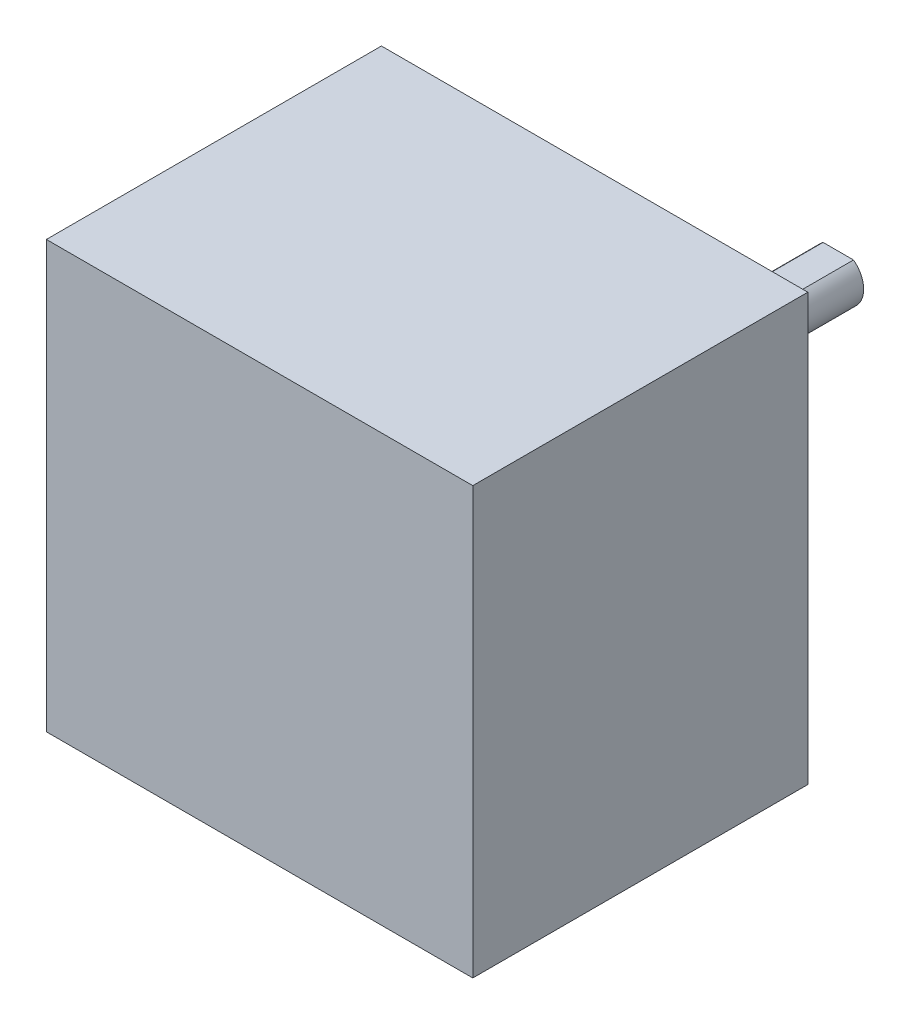
ISO-10303-21;
HEADER;
FILE_DESCRIPTION(('STEP AP214'),'2;1');
FILE_NAME('part.step','',(''),(''),'','','');
FILE_SCHEMA(('AUTOMOTIVE_DESIGN { 1 0 10303 214 1 1 1 1 }'));
ENDSEC;
DATA;
#1=APPLICATION_CONTEXT('core data for automotive mechanical design processes');
#2=APPLICATION_PROTOCOL_DEFINITION('international standard','automotive_design',2000,#1);
#3=PRODUCT_CONTEXT('',#1,'mechanical');
#4=PRODUCT('Part','Part','',(#3));
#5=PRODUCT_RELATED_PRODUCT_CATEGORY('part','',(#4));
#6=PRODUCT_DEFINITION_FORMATION('','',#4);
#7=PRODUCT_DEFINITION_CONTEXT('part definition',#1,'design');
#8=PRODUCT_DEFINITION('design','',#6,#7);
#9=PRODUCT_DEFINITION_SHAPE('','',#8);
#10=(LENGTH_UNIT() NAMED_UNIT(*) SI_UNIT(.MILLI.,.METRE.));
#11=(NAMED_UNIT(*) PLANE_ANGLE_UNIT() SI_UNIT($,.RADIAN.));
#12=(NAMED_UNIT(*) SI_UNIT($,.STERADIAN.) SOLID_ANGLE_UNIT());
#13=UNCERTAINTY_MEASURE_WITH_UNIT(LENGTH_MEASURE(1.E-05),#10,'distance_accuracy_value','');
#14=(GEOMETRIC_REPRESENTATION_CONTEXT(3) GLOBAL_UNCERTAINTY_ASSIGNED_CONTEXT((#13)) GLOBAL_UNIT_ASSIGNED_CONTEXT((#10,
#11,#12)) REPRESENTATION_CONTEXT('',''));
#15=CARTESIAN_POINT('',(0.,0.,0.));
#16=DIRECTION('',(0.,0.,1.));
#17=DIRECTION('',(1.,0.,0.));
#18=AXIS2_PLACEMENT_3D('',#15,#16,#17);
#19=CARTESIAN_POINT('',(0.,0.,-24.));
#20=DIRECTION('',(0.,0.,1.));
#21=DIRECTION('',(1.,0.,0.));
#22=AXIS2_PLACEMENT_3D('',#19,#20,#21);
#23=CYLINDRICAL_SURFACE('',#22,2.5);
#24=CARTESIAN_POINT('',(0.,0.,-2.));
#25=DIRECTION('',(0.,0.,-1.));
#26=DIRECTION('',(-1.,0.,0.));
#27=AXIS2_PLACEMENT_3D('',#24,#25,#26);
#28=CIRCLE('',#27,2.5);
#29=CARTESIAN_POINT('',(-2.5,0.,-2.));
#30=VERTEX_POINT('',#29);
#31=EDGE_CURVE('E11',#30,#30,#28,.T.);
#32=ORIENTED_EDGE('',*,*,#31,.T.);
#33=EDGE_LOOP('',(#32));
#34=FACE_BOUND('',#33,.T.);
#35=DIRECTION('',(0.,0.,-1.));
#36=VECTOR('',#35,1.);
#37=CARTESIAN_POINT('',(-1.5,2.,-4.));
#38=LINE('',#37,#36);
#39=CARTESIAN_POINT('',(-1.5,2.,-4.));
#40=VERTEX_POINT('',#39);
#41=CARTESIAN_POINT('',(-1.5,2.,-24.));
#42=VERTEX_POINT('',#41);
#43=EDGE_CURVE('E97',#40,#42,#38,.T.);
#44=ORIENTED_EDGE('',*,*,#43,.T.);
#45=CARTESIAN_POINT('',(0.,0.,-24.));
#46=DIRECTION('',(0.,0.,-1.));
#47=DIRECTION('',(-1.,0.,0.));
#48=AXIS2_PLACEMENT_3D('',#45,#46,#47);
#49=CIRCLE('',#48,2.5);
#50=CARTESIAN_POINT('',(1.5,2.,-24.));
#51=VERTEX_POINT('',#50);
#52=EDGE_CURVE('E115',#51,#42,#49,.T.);
#53=ORIENTED_EDGE('',*,*,#52,.F.);
#54=DIRECTION('',(0.,0.,-1.));
#55=VECTOR('',#54,1.);
#56=CARTESIAN_POINT('',(1.5,2.,-4.));
#57=LINE('',#56,#55);
#58=CARTESIAN_POINT('',(1.5,2.,-4.));
#59=VERTEX_POINT('',#58);
#60=EDGE_CURVE('E51',#59,#51,#57,.T.);
#61=ORIENTED_EDGE('',*,*,#60,.F.);
#62=CARTESIAN_POINT('',(0.,0.,-4.));
#63=DIRECTION('',(0.,0.,-1.));
#64=DIRECTION('',(-1.,0.,0.));
#65=AXIS2_PLACEMENT_3D('',#62,#63,#64);
#66=CIRCLE('',#65,2.5);
#67=EDGE_CURVE('E107',#40,#59,#66,.T.);
#68=ORIENTED_EDGE('',*,*,#67,.F.);
#69=EDGE_LOOP('',(#44,#53,#61,#68));
#70=FACE_BOUND('',#69,.T.);
#71=ADVANCED_FACE('F34',(#34,#70),#23,.T.);
#72=CARTESIAN_POINT('',(0.,0.,-24.));
#73=DIRECTION('',(0.,0.,-1.));
#74=DIRECTION('',(-1.,0.,0.));
#75=AXIS2_PLACEMENT_3D('',#72,#73,#74);
#76=PLANE('',#75);
#77=ORIENTED_EDGE('',*,*,#52,.T.);
#78=DIRECTION('',(1.,0.,0.));
#79=VECTOR('',#78,1.);
#80=CARTESIAN_POINT('',(0.,2.,-24.));
#81=LINE('',#80,#79);
#82=EDGE_CURVE('E102',#42,#51,#81,.T.);
#83=ORIENTED_EDGE('',*,*,#82,.T.);
#84=EDGE_LOOP('',(#77,#83));
#85=FACE_BOUND('',#84,.T.);
#86=ADVANCED_FACE('F168',(#85),#76,.T.);
#87=CARTESIAN_POINT('',(21.,-21.,33.));
#88=DIRECTION('',(-1.,0.,0.));
#89=DIRECTION('',(0.,0.,1.));
#90=AXIS2_PLACEMENT_3D('',#87,#88,#89);
#91=PLANE('',#90);
#92=DIRECTION('',(0.,1.,0.));
#93=VECTOR('',#92,1.);
#94=CARTESIAN_POINT('',(21.,-21.,0.));
#95=LINE('',#94,#93);
#96=CARTESIAN_POINT('',(21.,-21.,0.));
#97=VERTEX_POINT('',#96);
#98=CARTESIAN_POINT('',(21.,21.,0.));
#99=VERTEX_POINT('',#98);
#100=EDGE_CURVE('E121',#97,#99,#95,.T.);
#101=ORIENTED_EDGE('',*,*,#100,.T.);
#102=DIRECTION('',(0.,0.,-1.));
#103=VECTOR('',#102,1.);
#104=CARTESIAN_POINT('',(21.,21.,33.));
#105=LINE('',#104,#103);
#106=CARTESIAN_POINT('',(21.,21.,33.));
#107=VERTEX_POINT('',#106);
#108=EDGE_CURVE('E38',#107,#99,#105,.T.);
#109=ORIENTED_EDGE('',*,*,#108,.F.);
#110=DIRECTION('',(0.,1.,0.));
#111=VECTOR('',#110,1.);
#112=CARTESIAN_POINT('',(21.,-21.,33.));
#113=LINE('',#112,#111);
#114=CARTESIAN_POINT('',(21.,-21.,33.));
#115=VERTEX_POINT('',#114);
#116=EDGE_CURVE('E124',#115,#107,#113,.T.);
#117=ORIENTED_EDGE('',*,*,#116,.F.);
#118=DIRECTION('',(0.,0.,-1.));
#119=VECTOR('',#118,1.);
#120=CARTESIAN_POINT('',(21.,-21.,33.));
#121=LINE('',#120,#119);
#122=EDGE_CURVE('E130',#115,#97,#121,.T.);
#123=ORIENTED_EDGE('',*,*,#122,.T.);
#124=EDGE_LOOP('',(#101,#109,#117,#123));
#125=FACE_BOUND('',#124,.T.);
#126=ADVANCED_FACE('F36',(#125),#91,.F.);
#127=CARTESIAN_POINT('',(-21.,21.,33.));
#128=DIRECTION('',(0.,-1.,0.));
#129=DIRECTION('',(0.,0.,-1.));
#130=AXIS2_PLACEMENT_3D('',#127,#128,#129);
#131=PLANE('',#130);
#132=DIRECTION('',(-1.,0.,0.));
#133=VECTOR('',#132,1.);
#134=CARTESIAN_POINT('',(-21.,21.,0.));
#135=LINE('',#134,#133);
#136=CARTESIAN_POINT('',(-21.,21.,0.));
#137=VERTEX_POINT('',#136);
#138=EDGE_CURVE('E133',#99,#137,#135,.T.);
#139=ORIENTED_EDGE('',*,*,#138,.T.);
#140=DIRECTION('',(0.,0.,-1.));
#141=VECTOR('',#140,1.);
#142=CARTESIAN_POINT('',(-21.,21.,33.));
#143=LINE('',#142,#141);
#144=CARTESIAN_POINT('',(-21.,21.,33.));
#145=VERTEX_POINT('',#144);
#146=EDGE_CURVE('E140',#145,#137,#143,.T.);
#147=ORIENTED_EDGE('',*,*,#146,.F.);
#148=DIRECTION('',(-1.,0.,0.));
#149=VECTOR('',#148,1.);
#150=CARTESIAN_POINT('',(-21.,21.,33.));
#151=LINE('',#150,#149);
#152=EDGE_CURVE('E89',#107,#145,#151,.T.);
#153=ORIENTED_EDGE('',*,*,#152,.F.);
#154=ORIENTED_EDGE('',*,*,#108,.T.);
#155=EDGE_LOOP('',(#139,#147,#153,#154));
#156=FACE_BOUND('',#155,.T.);
#157=ADVANCED_FACE('F146',(#156),#131,.F.);
#158=CARTESIAN_POINT('',(-21.,-21.,33.));
#159=DIRECTION('',(1.,0.,0.));
#160=DIRECTION('',(0.,0.,-1.));
#161=AXIS2_PLACEMENT_3D('',#158,#159,#160);
#162=PLANE('',#161);
#163=DIRECTION('',(0.,-1.,0.));
#164=VECTOR('',#163,1.);
#165=CARTESIAN_POINT('',(-21.,-21.,0.));
#166=LINE('',#165,#164);
#167=CARTESIAN_POINT('',(-21.,-21.,0.));
#168=VERTEX_POINT('',#167);
#169=EDGE_CURVE('E135',#137,#168,#166,.T.);
#170=ORIENTED_EDGE('',*,*,#169,.T.);
#171=DIRECTION('',(0.,0.,-1.));
#172=VECTOR('',#171,1.);
#173=CARTESIAN_POINT('',(-21.,-21.,33.));
#174=LINE('',#173,#172);
#175=CARTESIAN_POINT('',(-21.,-21.,33.));
#176=VERTEX_POINT('',#175);
#177=EDGE_CURVE('E139',#176,#168,#174,.T.);
#178=ORIENTED_EDGE('',*,*,#177,.F.);
#179=DIRECTION('',(0.,-1.,0.));
#180=VECTOR('',#179,1.);
#181=CARTESIAN_POINT('',(-21.,-21.,33.));
#182=LINE('',#181,#180);
#183=EDGE_CURVE('E127',#145,#176,#182,.T.);
#184=ORIENTED_EDGE('',*,*,#183,.F.);
#185=ORIENTED_EDGE('',*,*,#146,.T.);
#186=EDGE_LOOP('',(#170,#178,#184,#185));
#187=FACE_BOUND('',#186,.T.);
#188=ADVANCED_FACE('F153',(#187),#162,.F.);
#189=CARTESIAN_POINT('',(-21.,-21.,33.));
#190=DIRECTION('',(0.,1.,0.));
#191=DIRECTION('',(0.,0.,1.));
#192=AXIS2_PLACEMENT_3D('',#189,#190,#191);
#193=PLANE('',#192);
#194=DIRECTION('',(1.,0.,0.));
#195=VECTOR('',#194,1.);
#196=CARTESIAN_POINT('',(-21.,-21.,0.));
#197=LINE('',#196,#195);
#198=EDGE_CURVE('E81',#168,#97,#197,.T.);
#199=ORIENTED_EDGE('',*,*,#198,.T.);
#200=ORIENTED_EDGE('',*,*,#122,.F.);
#201=DIRECTION('',(1.,0.,0.));
#202=VECTOR('',#201,1.);
#203=CARTESIAN_POINT('',(-21.,-21.,33.));
#204=LINE('',#203,#202);
#205=EDGE_CURVE('E60',#176,#115,#204,.T.);
#206=ORIENTED_EDGE('',*,*,#205,.F.);
#207=ORIENTED_EDGE('',*,*,#177,.T.);
#208=EDGE_LOOP('',(#199,#200,#206,#207));
#209=FACE_BOUND('',#208,.T.);
#210=ADVANCED_FACE('F154',(#209),#193,.F.);
#211=CARTESIAN_POINT('',(0.,0.,33.));
#212=DIRECTION('',(0.,0.,-1.));
#213=DIRECTION('',(-1.,0.,0.));
#214=AXIS2_PLACEMENT_3D('',#211,#212,#213);
#215=PLANE('',#214);
#216=ORIENTED_EDGE('',*,*,#116,.T.);
#217=ORIENTED_EDGE('',*,*,#152,.T.);
#218=ORIENTED_EDGE('',*,*,#183,.T.);
#219=ORIENTED_EDGE('',*,*,#205,.T.);
#220=EDGE_LOOP('',(#216,#217,#218,#219));
#221=FACE_BOUND('',#220,.T.);
#222=ADVANCED_FACE('F155',(#221),#215,.F.);
#223=CARTESIAN_POINT('',(0.,0.,0.));
#224=DIRECTION('',(0.,0.,-1.));
#225=DIRECTION('',(-1.,0.,0.));
#226=AXIS2_PLACEMENT_3D('',#223,#224,#225);
#227=PLANE('',#226);
#228=CARTESIAN_POINT('',(0.,0.,0.));
#229=DIRECTION('',(0.,0.,-1.));
#230=DIRECTION('',(-1.,0.,0.));
#231=AXIS2_PLACEMENT_3D('',#228,#229,#230);
#232=CIRCLE('',#231,11.7935371844737);
#233=CARTESIAN_POINT('',(-11.7935371844737,0.,0.));
#234=VERTEX_POINT('',#233);
#235=EDGE_CURVE('E43',#234,#234,#232,.T.);
#236=ORIENTED_EDGE('',*,*,#235,.F.);
#237=EDGE_LOOP('',(#236));
#238=FACE_BOUND('',#237,.T.);
#239=ORIENTED_EDGE('',*,*,#100,.F.);
#240=ORIENTED_EDGE('',*,*,#198,.F.);
#241=ORIENTED_EDGE('',*,*,#169,.F.);
#242=ORIENTED_EDGE('',*,*,#138,.F.);
#243=EDGE_LOOP('',(#239,#240,#241,#242));
#244=FACE_BOUND('',#243,.T.);
#245=ADVANCED_FACE('F151',(#238,#244),#227,.T.);
#246=CARTESIAN_POINT('',(0.,0.,-2.));
#247=DIRECTION('',(0.,0.,1.));
#248=DIRECTION('',(1.,0.,0.));
#249=AXIS2_PLACEMENT_3D('',#246,#247,#248);
#250=CYLINDRICAL_SURFACE('',#249,11.7935371844737);
#251=CARTESIAN_POINT('',(0.,0.,-2.));
#252=DIRECTION('',(0.,0.,-1.));
#253=DIRECTION('',(-1.,0.,0.));
#254=AXIS2_PLACEMENT_3D('',#251,#252,#253);
#255=CIRCLE('',#254,11.7935371844737);
#256=CARTESIAN_POINT('',(-11.7935371844737,0.,-2.));
#257=VERTEX_POINT('',#256);
#258=EDGE_CURVE('E117',#257,#257,#255,.T.);
#259=ORIENTED_EDGE('',*,*,#258,.F.);
#260=EDGE_LOOP('',(#259));
#261=FACE_BOUND('',#260,.T.);
#262=ORIENTED_EDGE('',*,*,#235,.T.);
#263=EDGE_LOOP('',(#262));
#264=FACE_BOUND('',#263,.T.);
#265=ADVANCED_FACE('F162',(#261,#264),#250,.T.);
#266=CARTESIAN_POINT('',(0.,0.,-2.));
#267=DIRECTION('',(0.,0.,-1.));
#268=DIRECTION('',(-1.,0.,0.));
#269=AXIS2_PLACEMENT_3D('',#266,#267,#268);
#270=PLANE('',#269);
#271=ORIENTED_EDGE('',*,*,#31,.F.);
#272=EDGE_LOOP('',(#271));
#273=FACE_BOUND('',#272,.T.);
#274=ORIENTED_EDGE('',*,*,#258,.T.);
#275=EDGE_LOOP('',(#274));
#276=FACE_BOUND('',#275,.T.);
#277=ADVANCED_FACE('F178',(#273,#276),#270,.T.);
#278=CARTESIAN_POINT('',(0.,2.,-4.));
#279=DIRECTION('',(0.,1.,0.));
#280=DIRECTION('',(-1.,0.,0.));
#281=AXIS2_PLACEMENT_3D('',#278,#279,#280);
#282=PLANE('',#281);
#283=ORIENTED_EDGE('',*,*,#82,.F.);
#284=ORIENTED_EDGE('',*,*,#43,.F.);
#285=DIRECTION('',(1.,0.,0.));
#286=VECTOR('',#285,1.);
#287=CARTESIAN_POINT('',(0.,2.,-4.));
#288=LINE('',#287,#286);
#289=EDGE_CURVE('E100',#40,#59,#288,.T.);
#290=ORIENTED_EDGE('',*,*,#289,.T.);
#291=ORIENTED_EDGE('',*,*,#60,.T.);
#292=EDGE_LOOP('',(#283,#284,#290,#291));
#293=FACE_BOUND('',#292,.T.);
#294=ADVANCED_FACE('F99',(#293),#282,.T.);
#295=CARTESIAN_POINT('',(0.,0.,-4.));
#296=DIRECTION('',(0.,0.,-1.));
#297=DIRECTION('',(-1.,0.,0.));
#298=AXIS2_PLACEMENT_3D('',#295,#296,#297);
#299=PLANE('',#298);
#300=ORIENTED_EDGE('',*,*,#289,.F.);
#301=ORIENTED_EDGE('',*,*,#67,.T.);
#302=EDGE_LOOP('',(#300,#301));
#303=FACE_BOUND('',#302,.T.);
#304=ADVANCED_FACE('F110',(#303),#299,.T.);
#305=CLOSED_SHELL('',(#71,#86,#126,#157,#188,#210,#222,#245,#265,#277,#294,#304));
#306=MANIFOLD_SOLID_BREP('B2',#305);
#307=ADVANCED_BREP_SHAPE_REPRESENTATION('',(#18,#306),#14);
#308=SHAPE_DEFINITION_REPRESENTATION(#9,#307);
ENDSEC;
END-ISO-10303-21;
